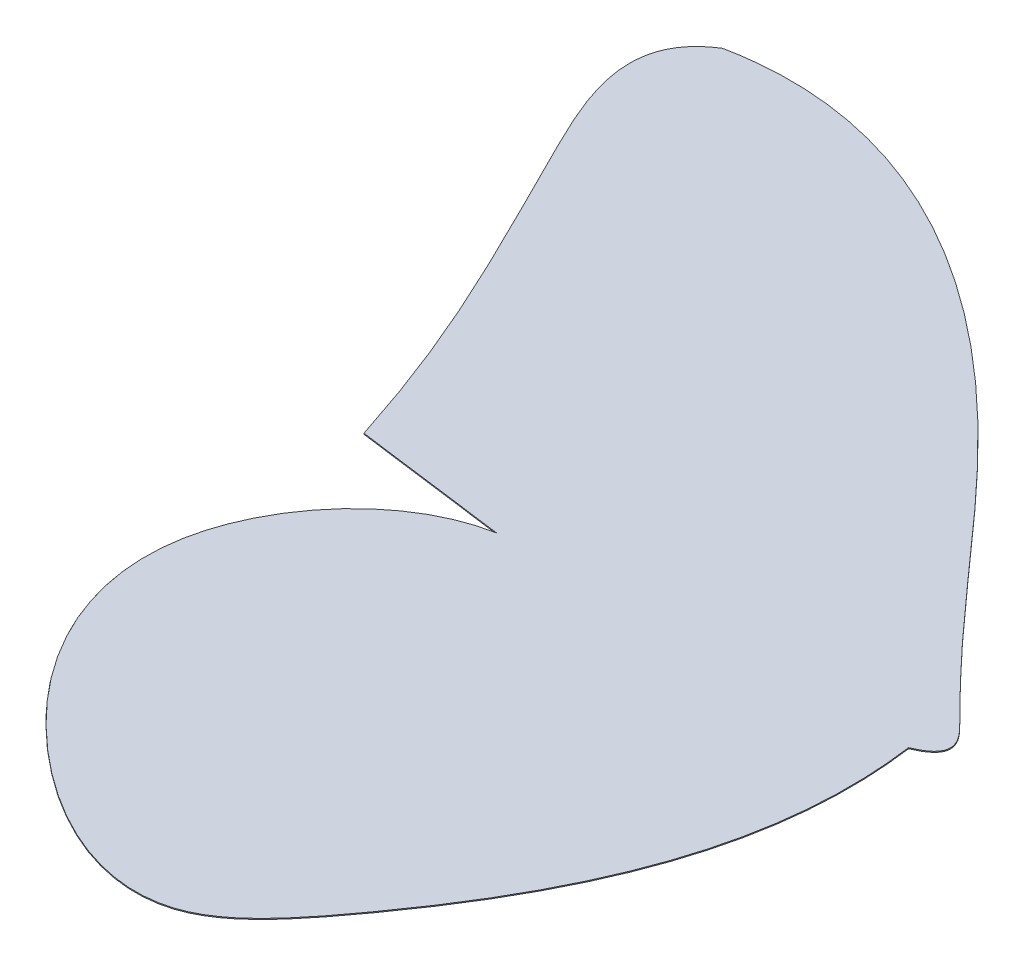
ISO-10303-21;
HEADER;
FILE_DESCRIPTION(('STEP AP214'),'2;1');
FILE_NAME('part.step','',(''),(''),'','','');
FILE_SCHEMA(('AUTOMOTIVE_DESIGN { 1 0 10303 214 1 1 1 1 }'));
ENDSEC;
DATA;
#1=APPLICATION_CONTEXT('core data for automotive mechanical design processes');
#2=APPLICATION_PROTOCOL_DEFINITION('international standard','automotive_design',2000,#1);
#3=PRODUCT_CONTEXT('',#1,'mechanical');
#4=PRODUCT('Part','Part','',(#3));
#5=PRODUCT_RELATED_PRODUCT_CATEGORY('part','',(#4));
#6=PRODUCT_DEFINITION_FORMATION('','',#4);
#7=PRODUCT_DEFINITION_CONTEXT('part definition',#1,'design');
#8=PRODUCT_DEFINITION('design','',#6,#7);
#9=PRODUCT_DEFINITION_SHAPE('','',#8);
#10=(LENGTH_UNIT() NAMED_UNIT(*) SI_UNIT(.MILLI.,.METRE.));
#11=(NAMED_UNIT(*) PLANE_ANGLE_UNIT() SI_UNIT($,.RADIAN.));
#12=(NAMED_UNIT(*) SI_UNIT($,.STERADIAN.) SOLID_ANGLE_UNIT());
#13=UNCERTAINTY_MEASURE_WITH_UNIT(LENGTH_MEASURE(1.E-05),#10,'distance_accuracy_value','');
#14=(GEOMETRIC_REPRESENTATION_CONTEXT(3) GLOBAL_UNCERTAINTY_ASSIGNED_CONTEXT((#13)) GLOBAL_UNIT_ASSIGNED_CONTEXT((#10,
#11,#12)) REPRESENTATION_CONTEXT('',''));
#15=CARTESIAN_POINT('',(0.,0.,0.));
#16=DIRECTION('',(0.,0.,1.));
#17=DIRECTION('',(1.,0.,0.));
#18=AXIS2_PLACEMENT_3D('',#15,#16,#17);
#19=CARTESIAN_POINT('',(0.,0.,0.));
#20=DIRECTION('',(0.,1.,0.));
#21=DIRECTION('',(0.,0.,1.));
#22=AXIS2_PLACEMENT_3D('',#19,#20,#21);
#23=PLANE('',#22);
#24=CARTESIAN_POINT('',(912.58505810736,0.,1380.70743932327));
#25=CARTESIAN_POINT('',(1313.1182600635,0.,1433.20360861717));
#26=B_SPLINE_CURVE_WITH_KNOTS('',1,(#24,#25),.UNSPECIFIED.,.F.,.F.,(2,2),(0.,1.),.UNSPECIFIED.);
#27=CARTESIAN_POINT('',(912.58505810736,0.,1380.70743932327));
#28=VERTEX_POINT('',#27);
#29=CARTESIAN_POINT('',(1313.1182600635,0.,1433.20360861717));
#30=VERTEX_POINT('',#29);
#31=EDGE_CURVE('E63',#28,#30,#26,.T.);
#32=ORIENTED_EDGE('',*,*,#31,.F.);
#33=CARTESIAN_POINT('',(508.214752154321,0.,36.449395209107));
#34=CARTESIAN_POINT('',(347.730227542964,0.,136.113323122075));
#35=CARTESIAN_POINT('',(626.2167832523,0.,707.789047244326));
#36=CARTESIAN_POINT('',(799.362573133956,0.,1030.84206330742));
#37=CARTESIAN_POINT('',(912.58505810736,0.,1380.70743932327));
#38=B_SPLINE_CURVE_WITH_KNOTS('',3,(#33,#34,#35,#36,#37),.UNSPECIFIED.,.F.,.F.,(4,1,4),(0.,
0.335601035831551,1.),.UNSPECIFIED.);
#39=CARTESIAN_POINT('',(508.214752154321,0.,36.449395209107));
#40=VERTEX_POINT('',#39);
#41=EDGE_CURVE('E83',#40,#28,#38,.T.);
#42=ORIENTED_EDGE('',*,*,#41,.F.);
#43=CARTESIAN_POINT('',(2340.63154399557,0.,1380.70743932327));
#44=CARTESIAN_POINT('',(2437.40246242234,0.,1339.93549687847));
#45=CARTESIAN_POINT('',(2118.5738202371,0.,1036.085136387));
#46=CARTESIAN_POINT('',(1690.70801305265,0.,467.116998919322));
#47=CARTESIAN_POINT('',(955.38327464776,0.,-54.9699299744977));
#48=CARTESIAN_POINT('',(508.214752154321,0.,36.4493952091073));
#49=B_SPLINE_CURVE_WITH_KNOTS('',3,(#43,#44,#45,#46,#47,#48),.UNSPECIFIED.,.F.,.F.,(4,1,1,4),
(0.,0.0710668067738606,0.453959707854682,1.),.UNSPECIFIED.);
#50=CARTESIAN_POINT('',(2340.63154399557,0.,1380.70743932327));
#51=VERTEX_POINT('',#50);
#52=EDGE_CURVE('E89',#51,#40,#49,.T.);
#53=ORIENTED_EDGE('',*,*,#52,.F.);
#54=CARTESIAN_POINT('',(1313.1182600635,0.,1433.20360861717));
#55=CARTESIAN_POINT('',(1106.80239765173,0.,1470.75872937305));
#56=CARTESIAN_POINT('',(761.27456398842,0.,1890.41871978903));
#57=CARTESIAN_POINT('',(1112.63777402218,0.,2520.9592917352));
#58=CARTESIAN_POINT('',(1714.42977789487,0.,2829.48488706724));
#59=CARTESIAN_POINT('',(2197.49440580448,0.,2240.02698712789));
#60=CARTESIAN_POINT('',(2397.36219919615,0.,1797.20206013556));
#61=CARTESIAN_POINT('',(2340.63154399557,0.,1380.70743932327));
#62=B_SPLINE_CURVE_WITH_KNOTS('',3,(#54,#55,#56,#57,#58,#59,#60,#61),.UNSPECIFIED.,.F.,.F.,(4,1,
1,1,1,4),(0.,0.180767113784559,0.388096447968587,0.561369391182913,0.651443692088062,1.),.UNSPECIFIED.);
#63=EDGE_CURVE('E94',#30,#51,#62,.T.);
#64=ORIENTED_EDGE('',*,*,#63,.F.);
#65=EDGE_LOOP('',(#32,#42,#53,#64));
#66=FACE_BOUND('',#65,.T.);
#67=ADVANCED_FACE('F39',(#66),#23,.F.);
#68=CARTESIAN_POINT('',(912.58505810736,0.,1380.70743932327));
#69=DIRECTION('',(-0.129954273207118,0.,0.991519988137006));
#70=DIRECTION('',(0.991519988137007,0.,0.129954273207118));
#71=AXIS2_PLACEMENT_3D('',#68,#69,#70);
#72=PLANE('',#71);
#73=CARTESIAN_POINT('',(912.58505810736,2.54,1380.70743932327));
#74=CARTESIAN_POINT('',(1313.1182600635,2.54,1433.20360861717));
#75=B_SPLINE_CURVE_WITH_KNOTS('',1,(#73,#74),.UNSPECIFIED.,.F.,.F.,(2,2),(0.,1.),.UNSPECIFIED.);
#76=CARTESIAN_POINT('',(912.58505810736,2.54,1380.70743932327));
#77=VERTEX_POINT('',#76);
#78=CARTESIAN_POINT('',(1313.1182600635,2.54,1433.20360861717));
#79=VERTEX_POINT('',#78);
#80=EDGE_CURVE('E105',#77,#79,#75,.T.);
#81=ORIENTED_EDGE('',*,*,#80,.F.);
#82=DIRECTION('',(0.,1.,0.));
#83=VECTOR('',#82,1.);
#84=CARTESIAN_POINT('',(912.58505810736,0.,1380.70743932327));
#85=LINE('',#84,#83);
#86=EDGE_CURVE('E12',#28,#77,#85,.T.);
#87=ORIENTED_EDGE('',*,*,#86,.F.);
#88=ORIENTED_EDGE('',*,*,#31,.T.);
#89=DIRECTION('',(0.,1.,0.));
#90=VECTOR('',#89,1.);
#91=CARTESIAN_POINT('',(1313.1182600635,0.,1433.20360861717));
#92=LINE('',#91,#90);
#93=EDGE_CURVE('E42',#30,#79,#92,.T.);
#94=ORIENTED_EDGE('',*,*,#93,.T.);
#95=EDGE_LOOP('',(#81,#87,#88,#94));
#96=FACE_BOUND('',#95,.T.);
#97=ADVANCED_FACE('F115',(#96),#72,.T.);
#98=DIRECTION('',(0.,1.,0.));
#99=VECTOR('',#98,1.);
#100=SURFACE_OF_LINEAR_EXTRUSION('',#38,#99);
#101=CARTESIAN_POINT('',(508.214752154321,2.54,36.449395209107));
#102=CARTESIAN_POINT('',(347.730227542964,2.54,136.113323122075));
#103=CARTESIAN_POINT('',(626.2167832523,2.54,707.789047244326));
#104=CARTESIAN_POINT('',(799.362573133956,2.54,1030.84206330742));
#105=CARTESIAN_POINT('',(912.58505810736,2.54,1380.70743932327));
#106=B_SPLINE_CURVE_WITH_KNOTS('',3,(#101,#102,#103,#104,#105),.UNSPECIFIED.,.F.,.F.,(4,1,4),
(0.,0.335601035831551,1.),.UNSPECIFIED.);
#107=CARTESIAN_POINT('',(508.214752154321,2.54,36.449395209107));
#108=VERTEX_POINT('',#107);
#109=EDGE_CURVE('E85',#108,#77,#106,.T.);
#110=ORIENTED_EDGE('',*,*,#109,.F.);
#111=DIRECTION('',(0.,1.,0.));
#112=VECTOR('',#111,1.);
#113=CARTESIAN_POINT('',(508.214752154321,0.,36.449395209107));
#114=LINE('',#113,#112);
#115=EDGE_CURVE('E47',#40,#108,#114,.T.);
#116=ORIENTED_EDGE('',*,*,#115,.F.);
#117=ORIENTED_EDGE('',*,*,#41,.T.);
#118=ORIENTED_EDGE('',*,*,#86,.T.);
#119=EDGE_LOOP('',(#110,#116,#117,#118));
#120=FACE_BOUND('',#119,.T.);
#121=ADVANCED_FACE('F81',(#120),#100,.T.);
#122=DIRECTION('',(0.,1.,0.));
#123=VECTOR('',#122,1.);
#124=SURFACE_OF_LINEAR_EXTRUSION('',#49,#123);
#125=CARTESIAN_POINT('',(2340.63154399557,2.54,1380.70743932327));
#126=CARTESIAN_POINT('',(2437.40246242234,2.54,1339.93549687847));
#127=CARTESIAN_POINT('',(2118.5738202371,2.54,1036.085136387));
#128=CARTESIAN_POINT('',(1690.70801305265,2.54,467.116998919322));
#129=CARTESIAN_POINT('',(955.38327464776,2.54,-54.9699299744977));
#130=CARTESIAN_POINT('',(508.214752154321,2.54,36.4493952091073));
#131=B_SPLINE_CURVE_WITH_KNOTS('',3,(#125,#126,#127,#128,#129,#130),.UNSPECIFIED.,.F.,.F.,(4,1,
1,4),(0.,0.0710668067738606,0.453959707854682,1.),.UNSPECIFIED.);
#132=CARTESIAN_POINT('',(2340.63154399557,2.54,1380.70743932327));
#133=VERTEX_POINT('',#132);
#134=EDGE_CURVE('E55',#133,#108,#131,.T.);
#135=ORIENTED_EDGE('',*,*,#134,.F.);
#136=DIRECTION('',(0.,1.,0.));
#137=VECTOR('',#136,1.);
#138=CARTESIAN_POINT('',(2340.63154399557,0.,1380.70743932327));
#139=LINE('',#138,#137);
#140=EDGE_CURVE('E86',#51,#133,#139,.T.);
#141=ORIENTED_EDGE('',*,*,#140,.F.);
#142=ORIENTED_EDGE('',*,*,#52,.T.);
#143=ORIENTED_EDGE('',*,*,#115,.T.);
#144=EDGE_LOOP('',(#135,#141,#142,#143));
#145=FACE_BOUND('',#144,.T.);
#146=ADVANCED_FACE('F90',(#145),#124,.T.);
#147=DIRECTION('',(0.,1.,0.));
#148=VECTOR('',#147,1.);
#149=SURFACE_OF_LINEAR_EXTRUSION('',#62,#148);
#150=CARTESIAN_POINT('',(1313.1182600635,2.54,1433.20360861717));
#151=CARTESIAN_POINT('',(1106.80239765173,2.54,1470.75872937305));
#152=CARTESIAN_POINT('',(761.27456398842,2.54,1890.41871978903));
#153=CARTESIAN_POINT('',(1112.63777402218,2.54,2520.9592917352));
#154=CARTESIAN_POINT('',(1714.42977789487,2.54,2829.48488706724));
#155=CARTESIAN_POINT('',(2197.49440580448,2.54,2240.02698712789));
#156=CARTESIAN_POINT('',(2397.36219919615,2.54,1797.20206013556));
#157=CARTESIAN_POINT('',(2340.63154399557,2.54,1380.70743932327));
#158=B_SPLINE_CURVE_WITH_KNOTS('',3,(#150,#151,#152,#153,#154,#155,#156,#157),.UNSPECIFIED.,.F.,
.F.,(4,1,1,1,1,4),(0.,0.180767113784559,0.388096447968587,0.561369391182913,0.651443692088062,
1.),.UNSPECIFIED.);
#159=EDGE_CURVE('E138',#79,#133,#158,.T.);
#160=ORIENTED_EDGE('',*,*,#159,.F.);
#161=ORIENTED_EDGE('',*,*,#93,.F.);
#162=ORIENTED_EDGE('',*,*,#63,.T.);
#163=ORIENTED_EDGE('',*,*,#140,.T.);
#164=EDGE_LOOP('',(#160,#161,#162,#163));
#165=FACE_BOUND('',#164,.T.);
#166=ADVANCED_FACE('F118',(#165),#149,.T.);
#167=CARTESIAN_POINT('',(0.,2.54,0.));
#168=DIRECTION('',(0.,1.,0.));
#169=DIRECTION('',(0.,0.,1.));
#170=AXIS2_PLACEMENT_3D('',#167,#168,#169);
#171=PLANE('',#170);
#172=ORIENTED_EDGE('',*,*,#109,.T.);
#173=ORIENTED_EDGE('',*,*,#80,.T.);
#174=ORIENTED_EDGE('',*,*,#159,.T.);
#175=ORIENTED_EDGE('',*,*,#134,.T.);
#176=EDGE_LOOP('',(#172,#173,#174,#175));
#177=FACE_BOUND('',#176,.T.);
#178=ADVANCED_FACE('F121',(#177),#171,.T.);
#179=CLOSED_SHELL('',(#67,#97,#121,#146,#166,#178));
#180=MANIFOLD_SOLID_BREP('B2',#179);
#181=ADVANCED_BREP_SHAPE_REPRESENTATION('',(#18,#180),#14);
#182=SHAPE_DEFINITION_REPRESENTATION(#9,#181);
ENDSEC;
END-ISO-10303-21;
